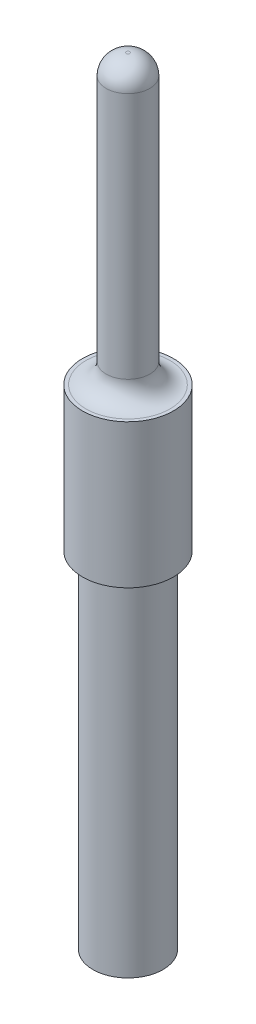
ISO-10303-21;
HEADER;
FILE_DESCRIPTION(('STEP AP214'),'2;1');
FILE_NAME('part.step','',(''),(''),'','','');
FILE_SCHEMA(('AUTOMOTIVE_DESIGN { 1 0 10303 214 1 1 1 1 }'));
ENDSEC;
DATA;
#1=APPLICATION_CONTEXT('core data for automotive mechanical design processes');
#2=APPLICATION_PROTOCOL_DEFINITION('international standard','automotive_design',2000,#1);
#3=PRODUCT_CONTEXT('',#1,'mechanical');
#4=PRODUCT('Part','Part','',(#3));
#5=PRODUCT_RELATED_PRODUCT_CATEGORY('part','',(#4));
#6=PRODUCT_DEFINITION_FORMATION('','',#4);
#7=PRODUCT_DEFINITION_CONTEXT('part definition',#1,'design');
#8=PRODUCT_DEFINITION('design','',#6,#7);
#9=PRODUCT_DEFINITION_SHAPE('','',#8);
#10=(LENGTH_UNIT() NAMED_UNIT(*) SI_UNIT(.MILLI.,.METRE.));
#11=(NAMED_UNIT(*) PLANE_ANGLE_UNIT() SI_UNIT($,.RADIAN.));
#12=(NAMED_UNIT(*) SI_UNIT($,.STERADIAN.) SOLID_ANGLE_UNIT());
#13=UNCERTAINTY_MEASURE_WITH_UNIT(LENGTH_MEASURE(1.E-05),#10,'distance_accuracy_value','');
#14=(GEOMETRIC_REPRESENTATION_CONTEXT(3) GLOBAL_UNCERTAINTY_ASSIGNED_CONTEXT((#13)) GLOBAL_UNIT_ASSIGNED_CONTEXT((#10,
#11,#12)) REPRESENTATION_CONTEXT('',''));
#15=CARTESIAN_POINT('',(0.,0.,0.));
#16=DIRECTION('',(0.,0.,1.));
#17=DIRECTION('',(1.,0.,0.));
#18=AXIS2_PLACEMENT_3D('',#15,#16,#17);
#19=CARTESIAN_POINT('',(0.,0.,0.));
#20=DIRECTION('',(0.,1.,0.));
#21=DIRECTION('',(0.,0.,1.));
#22=AXIS2_PLACEMENT_3D('',#19,#20,#21);
#23=PLANE('',#22);
#24=CARTESIAN_POINT('',(0.,0.,0.));
#25=DIRECTION('',(0.,1.,0.));
#26=DIRECTION('',(0.,0.,1.));
#27=AXIS2_PLACEMENT_3D('',#24,#25,#26);
#28=CIRCLE('',#27,0.61);
#29=CARTESIAN_POINT('',(0.,0.,0.61));
#30=VERTEX_POINT('',#29);
#31=EDGE_CURVE('E51',#30,#30,#28,.T.);
#32=ORIENTED_EDGE('',*,*,#31,.F.);
#33=EDGE_LOOP('',(#32));
#34=FACE_BOUND('',#33,.T.);
#35=CARTESIAN_POINT('',(0.,0.,0.));
#36=DIRECTION('',(0.,1.,0.));
#37=DIRECTION('',(0.,0.,1.));
#38=AXIS2_PLACEMENT_3D('',#35,#36,#37);
#39=CIRCLE('',#38,0.5);
#40=CARTESIAN_POINT('',(0.,0.,0.5));
#41=VERTEX_POINT('',#40);
#42=EDGE_CURVE('E54',#41,#41,#39,.T.);
#43=ORIENTED_EDGE('',*,*,#42,.T.);
#44=EDGE_LOOP('',(#43));
#45=FACE_BOUND('',#44,.T.);
#46=ADVANCED_FACE('F30',(#34,#45),#23,.F.);
#47=CARTESIAN_POINT('',(0.,6.,0.));
#48=DIRECTION('',(0.,-1.,0.));
#49=DIRECTION('',(0.,0.,-1.));
#50=AXIS2_PLACEMENT_3D('',#47,#48,#49);
#51=CYLINDRICAL_SURFACE('',#50,0.61);
#52=CARTESIAN_POINT('',(0.,6.,0.));
#53=DIRECTION('',(0.,1.,0.));
#54=DIRECTION('',(0.,0.,1.));
#55=AXIS2_PLACEMENT_3D('',#52,#53,#54);
#56=CIRCLE('',#55,0.61);
#57=CARTESIAN_POINT('',(0.,6.,0.61));
#58=VERTEX_POINT('',#57);
#59=EDGE_CURVE('E50',#58,#58,#56,.T.);
#60=ORIENTED_EDGE('',*,*,#59,.F.);
#61=EDGE_LOOP('',(#60));
#62=FACE_BOUND('',#61,.T.);
#63=ORIENTED_EDGE('',*,*,#31,.T.);
#64=EDGE_LOOP('',(#63));
#65=FACE_BOUND('',#64,.T.);
#66=ADVANCED_FACE('F94',(#62,#65),#51,.T.);
#67=CARTESIAN_POINT('',(0.,6.,0.));
#68=DIRECTION('',(0.,-1.,0.));
#69=DIRECTION('',(0.,0.,-1.));
#70=AXIS2_PLACEMENT_3D('',#67,#68,#69);
#71=CYLINDRICAL_SURFACE('',#70,0.5);
#72=CARTESIAN_POINT('',(0.,6.,0.));
#73=DIRECTION('',(0.,1.,0.));
#74=DIRECTION('',(0.,0.,1.));
#75=AXIS2_PLACEMENT_3D('',#72,#73,#74);
#76=CIRCLE('',#75,0.5);
#77=CARTESIAN_POINT('',(0.,6.,0.5));
#78=VERTEX_POINT('',#77);
#79=EDGE_CURVE('E59',#78,#78,#76,.T.);
#80=ORIENTED_EDGE('',*,*,#79,.T.);
#81=EDGE_LOOP('',(#80));
#82=FACE_BOUND('',#81,.T.);
#83=ORIENTED_EDGE('',*,*,#42,.F.);
#84=EDGE_LOOP('',(#83));
#85=FACE_BOUND('',#84,.T.);
#86=ADVANCED_FACE('F91',(#82,#85),#71,.F.);
#87=CARTESIAN_POINT('',(0.,6.,0.));
#88=DIRECTION('',(0.,1.,0.));
#89=DIRECTION('',(0.,0.,1.));
#90=AXIS2_PLACEMENT_3D('',#87,#88,#89);
#91=PLANE('',#90);
#92=ORIENTED_EDGE('',*,*,#79,.F.);
#93=EDGE_LOOP('',(#92));
#94=FACE_BOUND('',#93,.T.);
#95=ADVANCED_FACE('F74',(#94),#91,.F.);
#96=CARTESIAN_POINT('',(0.,8.5,0.));
#97=DIRECTION('',(0.,-1.,0.));
#98=DIRECTION('',(0.,0.,-1.));
#99=AXIS2_PLACEMENT_3D('',#96,#97,#98);
#100=CYLINDRICAL_SURFACE('',#99,0.79);
#101=CARTESIAN_POINT('',(0.,8.5,0.));
#102=DIRECTION('',(0.,1.,0.));
#103=DIRECTION('',(0.,0.,1.));
#104=AXIS2_PLACEMENT_3D('',#101,#102,#103);
#105=CIRCLE('',#104,0.79);
#106=CARTESIAN_POINT('',(0.,8.5,0.79));
#107=VERTEX_POINT('',#106);
#108=EDGE_CURVE('E62',#107,#107,#105,.T.);
#109=ORIENTED_EDGE('',*,*,#108,.F.);
#110=EDGE_LOOP('',(#109));
#111=FACE_BOUND('',#110,.T.);
#112=CARTESIAN_POINT('',(0.,6.,0.));
#113=DIRECTION('',(0.,1.,0.));
#114=DIRECTION('',(0.,0.,1.));
#115=AXIS2_PLACEMENT_3D('',#112,#113,#114);
#116=CIRCLE('',#115,0.79);
#117=CARTESIAN_POINT('',(0.,6.,0.79));
#118=VERTEX_POINT('',#117);
#119=EDGE_CURVE('E63',#118,#118,#116,.T.);
#120=ORIENTED_EDGE('',*,*,#119,.T.);
#121=EDGE_LOOP('',(#120));
#122=FACE_BOUND('',#121,.T.);
#123=ADVANCED_FACE('F71',(#111,#122),#100,.T.);
#124=CARTESIAN_POINT('',(0.,8.5,0.));
#125=DIRECTION('',(0.,1.,0.));
#126=DIRECTION('',(0.,0.,1.));
#127=AXIS2_PLACEMENT_3D('',#124,#125,#126);
#128=PLANE('',#127);
#129=CARTESIAN_POINT('',(0.,8.5,0.));
#130=DIRECTION('',(0.,1.,0.));
#131=DIRECTION('',(0.,0.,1.));
#132=AXIS2_PLACEMENT_3D('',#129,#130,#131);
#133=CIRCLE('',#132,0.73);
#134=CARTESIAN_POINT('',(0.,8.5,0.73));
#135=VERTEX_POINT('',#134);
#136=EDGE_CURVE('E10',#135,#135,#133,.F.);
#137=ORIENTED_EDGE('',*,*,#136,.T.);
#138=EDGE_LOOP('',(#137));
#139=FACE_BOUND('',#138,.T.);
#140=ORIENTED_EDGE('',*,*,#108,.T.);
#141=EDGE_LOOP('',(#140));
#142=FACE_BOUND('',#141,.T.);
#143=ADVANCED_FACE('F69',(#139,#142),#128,.T.);
#144=ORIENTED_EDGE('',*,*,#59,.T.);
#145=EDGE_LOOP('',(#144));
#146=FACE_BOUND('',#145,.T.);
#147=ORIENTED_EDGE('',*,*,#119,.F.);
#148=EDGE_LOOP('',(#147));
#149=FACE_BOUND('',#148,.T.);
#150=ADVANCED_FACE('F78',(#146,#149),#91,.F.);
#151=CARTESIAN_POINT('',(0.,13.5,0.));
#152=DIRECTION('',(0.,-1.,0.));
#153=DIRECTION('',(0.,0.,-1.));
#154=AXIS2_PLACEMENT_3D('',#151,#152,#153);
#155=CYLINDRICAL_SURFACE('',#154,0.38);
#156=CARTESIAN_POINT('',(0.,8.85,0.));
#157=DIRECTION('',(0.,1.,0.));
#158=DIRECTION('',(0.,0.,1.));
#159=AXIS2_PLACEMENT_3D('',#156,#157,#158);
#160=CIRCLE('',#159,0.38);
#161=CARTESIAN_POINT('',(0.,8.85,0.38));
#162=VERTEX_POINT('',#161);
#163=EDGE_CURVE('E37',#162,#162,#160,.T.);
#164=ORIENTED_EDGE('',*,*,#163,.T.);
#165=EDGE_LOOP('',(#164));
#166=FACE_BOUND('',#165,.T.);
#167=CARTESIAN_POINT('',(0.,13.15,0.));
#168=DIRECTION('',(0.,1.,0.));
#169=DIRECTION('',(0.,0.,1.));
#170=AXIS2_PLACEMENT_3D('',#167,#168,#169);
#171=CIRCLE('',#170,0.38);
#172=CARTESIAN_POINT('',(0.,13.15,0.38));
#173=VERTEX_POINT('',#172);
#174=EDGE_CURVE('E41',#173,#173,#171,.F.);
#175=ORIENTED_EDGE('',*,*,#174,.T.);
#176=EDGE_LOOP('',(#175));
#177=FACE_BOUND('',#176,.T.);
#178=ADVANCED_FACE('F80',(#166,#177),#155,.T.);
#179=CARTESIAN_POINT('',(0.,13.5,0.));
#180=DIRECTION('',(0.,1.,0.));
#181=DIRECTION('',(0.,0.,1.));
#182=AXIS2_PLACEMENT_3D('',#179,#180,#181);
#183=PLANE('',#182);
#184=CARTESIAN_POINT('',(0.,13.5,0.));
#185=DIRECTION('',(0.,1.,0.));
#186=DIRECTION('',(0.,0.,1.));
#187=AXIS2_PLACEMENT_3D('',#184,#185,#186);
#188=CIRCLE('',#187,0.03);
#189=CARTESIAN_POINT('',(0.,13.5,0.03));
#190=VERTEX_POINT('',#189);
#191=EDGE_CURVE('E45',#190,#190,#188,.T.);
#192=ORIENTED_EDGE('',*,*,#191,.T.);
#193=EDGE_LOOP('',(#192));
#194=FACE_BOUND('',#193,.T.);
#195=ADVANCED_FACE('F87',(#194),#183,.T.);
#196=CARTESIAN_POINT('',(0.,13.15,0.));
#197=DIRECTION('',(0.,1.,0.));
#198=DIRECTION('',(0.,0.,1.));
#199=AXIS2_PLACEMENT_3D('',#196,#197,#198);
#200=DEGENERATE_TOROIDAL_SURFACE('',#199,0.03,0.35,.T.);
#201=ORIENTED_EDGE('',*,*,#174,.F.);
#202=EDGE_LOOP('',(#201));
#203=FACE_BOUND('',#202,.T.);
#204=ORIENTED_EDGE('',*,*,#191,.F.);
#205=EDGE_LOOP('',(#204));
#206=FACE_BOUND('',#205,.T.);
#207=ADVANCED_FACE('F105',(#203,#206),#200,.T.);
#208=CARTESIAN_POINT('',(0.,8.85,0.));
#209=DIRECTION('',(0.,1.,0.));
#210=DIRECTION('',(0.,0.,1.));
#211=AXIS2_PLACEMENT_3D('',#208,#209,#210);
#212=TOROIDAL_SURFACE('',#211,0.73,0.35);
#213=ORIENTED_EDGE('',*,*,#136,.F.);
#214=EDGE_LOOP('',(#213));
#215=FACE_BOUND('',#214,.T.);
#216=ORIENTED_EDGE('',*,*,#163,.F.);
#217=EDGE_LOOP('',(#216));
#218=FACE_BOUND('',#217,.T.);
#219=ADVANCED_FACE('F32',(#215,#218),#212,.F.);
#220=CLOSED_SHELL('',(#46,#66,#86,#95,#123,#143,#150,#178,#195,#207,#219));
#221=MANIFOLD_SOLID_BREP('B2',#220);
#222=ADVANCED_BREP_SHAPE_REPRESENTATION('',(#18,#221),#14);
#223=SHAPE_DEFINITION_REPRESENTATION(#9,#222);
ENDSEC;
END-ISO-10303-21;
